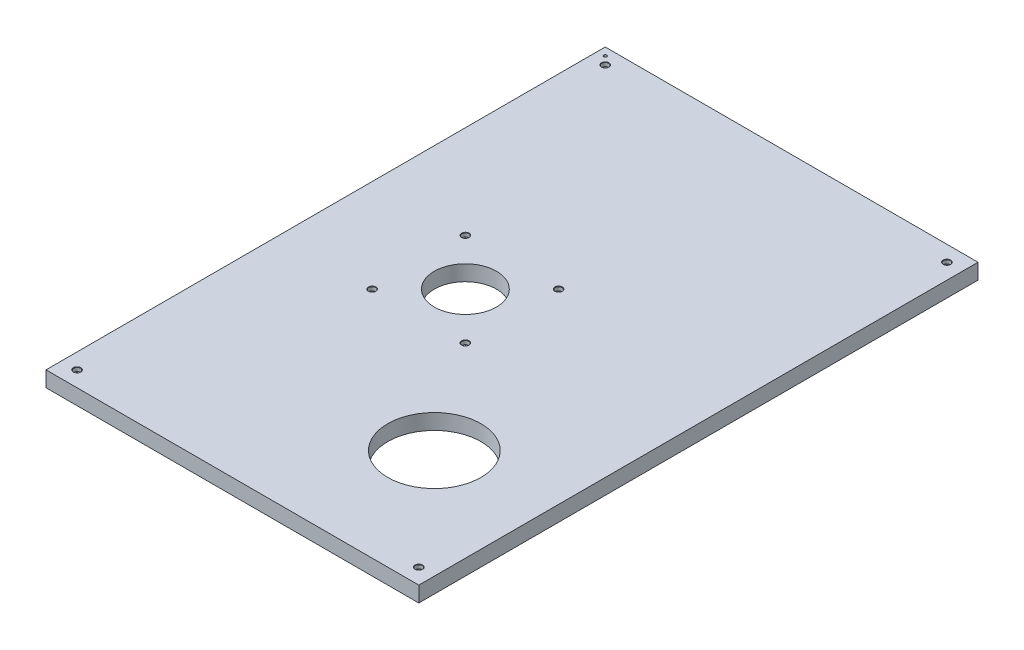
ISO-10303-21;
HEADER;
FILE_DESCRIPTION(('STEP AP214'),'2;1');
FILE_NAME('part.step','',(''),(''),'','','');
FILE_SCHEMA(('AUTOMOTIVE_DESIGN { 1 0 10303 214 1 1 1 1 }'));
ENDSEC;
DATA;
#1=APPLICATION_CONTEXT('core data for automotive mechanical design processes');
#2=APPLICATION_PROTOCOL_DEFINITION('international standard','automotive_design',2000,#1);
#3=PRODUCT_CONTEXT('',#1,'mechanical');
#4=PRODUCT('Part','Part','',(#3));
#5=PRODUCT_RELATED_PRODUCT_CATEGORY('part','',(#4));
#6=PRODUCT_DEFINITION_FORMATION('','',#4);
#7=PRODUCT_DEFINITION_CONTEXT('part definition',#1,'design');
#8=PRODUCT_DEFINITION('design','',#6,#7);
#9=PRODUCT_DEFINITION_SHAPE('','',#8);
#10=(LENGTH_UNIT() NAMED_UNIT(*) SI_UNIT(.MILLI.,.METRE.));
#11=(NAMED_UNIT(*) PLANE_ANGLE_UNIT() SI_UNIT($,.RADIAN.));
#12=(NAMED_UNIT(*) SI_UNIT($,.STERADIAN.) SOLID_ANGLE_UNIT());
#13=UNCERTAINTY_MEASURE_WITH_UNIT(LENGTH_MEASURE(1.E-05),#10,'distance_accuracy_value','');
#14=(GEOMETRIC_REPRESENTATION_CONTEXT(3) GLOBAL_UNCERTAINTY_ASSIGNED_CONTEXT((#13)) GLOBAL_UNIT_ASSIGNED_CONTEXT((#10,
#11,#12)) REPRESENTATION_CONTEXT('',''));
#15=CARTESIAN_POINT('',(0.,0.,0.));
#16=DIRECTION('',(0.,0.,1.));
#17=DIRECTION('',(1.,0.,0.));
#18=AXIS2_PLACEMENT_3D('',#15,#16,#17);
#19=CARTESIAN_POINT('',(354.288466199869,25.4,-449.231743950355));
#20=DIRECTION('',(1.,0.,0.));
#21=DIRECTION('',(0.,0.,-1.));
#22=AXIS2_PLACEMENT_3D('',#19,#20,#21);
#23=PLANE('',#22);
#24=DIRECTION('',(0.,0.,1.));
#25=VECTOR('',#24,1.);
#26=CARTESIAN_POINT('',(354.288466199869,0.,-449.231743950355));
#27=LINE('',#26,#25);
#28=CARTESIAN_POINT('',(354.288466199869,0.,-449.231743950355));
#29=VERTEX_POINT('',#28);
#30=CARTESIAN_POINT('',(354.288466199869,0.,465.168256049645));
#31=VERTEX_POINT('',#30);
#32=EDGE_CURVE('E97',#29,#31,#27,.T.);
#33=ORIENTED_EDGE('',*,*,#32,.T.);
#34=DIRECTION('',(0.,-1.,0.));
#35=VECTOR('',#34,1.);
#36=CARTESIAN_POINT('',(354.288466199869,25.4,465.168256049645));
#37=LINE('',#36,#35);
#38=CARTESIAN_POINT('',(354.288466199869,25.4,465.168256049645));
#39=VERTEX_POINT('',#38);
#40=EDGE_CURVE('E11',#39,#31,#37,.T.);
#41=ORIENTED_EDGE('',*,*,#40,.F.);
#42=DIRECTION('',(0.,0.,1.));
#43=VECTOR('',#42,1.);
#44=CARTESIAN_POINT('',(354.288466199869,25.4,-449.231743950355));
#45=LINE('',#44,#43);
#46=CARTESIAN_POINT('',(354.288466199869,25.4,-449.231743950355));
#47=VERTEX_POINT('',#46);
#48=EDGE_CURVE('E85',#47,#39,#45,.T.);
#49=ORIENTED_EDGE('',*,*,#48,.F.);
#50=DIRECTION('',(0.,-1.,0.));
#51=VECTOR('',#50,1.);
#52=CARTESIAN_POINT('',(354.288466199869,25.4,-449.231743950355));
#53=LINE('',#52,#51);
#54=EDGE_CURVE('E93',#47,#29,#53,.T.);
#55=ORIENTED_EDGE('',*,*,#54,.T.);
#56=EDGE_LOOP('',(#33,#41,#49,#55));
#57=FACE_BOUND('',#56,.T.);
#58=ADVANCED_FACE('F34',(#57),#23,.F.);
#59=CARTESIAN_POINT('',(354.288466199869,25.4,465.168256049645));
#60=DIRECTION('',(0.,0.,-1.));
#61=DIRECTION('',(-1.,0.,0.));
#62=AXIS2_PLACEMENT_3D('',#59,#60,#61);
#63=PLANE('',#62);
#64=DIRECTION('',(1.,0.,0.));
#65=VECTOR('',#64,1.);
#66=CARTESIAN_POINT('',(354.288466199869,0.,465.168256049645));
#67=LINE('',#66,#65);
#68=CARTESIAN_POINT('',(963.888466199869,0.,465.168256049645));
#69=VERTEX_POINT('',#68);
#70=EDGE_CURVE('E89',#31,#69,#67,.T.);
#71=ORIENTED_EDGE('',*,*,#70,.T.);
#72=DIRECTION('',(0.,-1.,0.));
#73=VECTOR('',#72,1.);
#74=CARTESIAN_POINT('',(963.888466199869,25.4,465.168256049645));
#75=LINE('',#74,#73);
#76=CARTESIAN_POINT('',(963.888466199869,25.4,465.168256049645));
#77=VERTEX_POINT('',#76);
#78=EDGE_CURVE('E42',#77,#69,#75,.T.);
#79=ORIENTED_EDGE('',*,*,#78,.F.);
#80=DIRECTION('',(1.,0.,0.));
#81=VECTOR('',#80,1.);
#82=CARTESIAN_POINT('',(354.288466199869,25.4,465.168256049645));
#83=LINE('',#82,#81);
#84=EDGE_CURVE('E80',#39,#77,#83,.T.);
#85=ORIENTED_EDGE('',*,*,#84,.F.);
#86=ORIENTED_EDGE('',*,*,#40,.T.);
#87=EDGE_LOOP('',(#71,#79,#85,#86));
#88=FACE_BOUND('',#87,.T.);
#89=ADVANCED_FACE('F88',(#88),#63,.F.);
#90=CARTESIAN_POINT('',(963.888466199869,25.4,-449.231743950355));
#91=DIRECTION('',(-1.,0.,0.));
#92=DIRECTION('',(0.,0.,1.));
#93=AXIS2_PLACEMENT_3D('',#90,#91,#92);
#94=PLANE('',#93);
#95=DIRECTION('',(0.,0.,-1.));
#96=VECTOR('',#95,1.);
#97=CARTESIAN_POINT('',(963.888466199869,0.,-449.231743950355));
#98=LINE('',#97,#96);
#99=CARTESIAN_POINT('',(963.888466199869,0.,-449.231743950355));
#100=VERTEX_POINT('',#99);
#101=EDGE_CURVE('E67',#69,#100,#98,.T.);
#102=ORIENTED_EDGE('',*,*,#101,.T.);
#103=DIRECTION('',(0.,-1.,0.));
#104=VECTOR('',#103,1.);
#105=CARTESIAN_POINT('',(963.888466199869,25.4,-449.231743950355));
#106=LINE('',#105,#104);
#107=CARTESIAN_POINT('',(963.888466199869,25.4,-449.231743950355));
#108=VERTEX_POINT('',#107);
#109=EDGE_CURVE('E90',#108,#100,#106,.T.);
#110=ORIENTED_EDGE('',*,*,#109,.F.);
#111=DIRECTION('',(0.,0.,-1.));
#112=VECTOR('',#111,1.);
#113=CARTESIAN_POINT('',(963.888466199869,25.4,-449.231743950355));
#114=LINE('',#113,#112);
#115=EDGE_CURVE('E83',#77,#108,#114,.T.);
#116=ORIENTED_EDGE('',*,*,#115,.F.);
#117=ORIENTED_EDGE('',*,*,#78,.T.);
#118=EDGE_LOOP('',(#102,#110,#116,#117));
#119=FACE_BOUND('',#118,.T.);
#120=ADVANCED_FACE('F91',(#119),#94,.F.);
#121=CARTESIAN_POINT('',(354.288466199869,25.4,-449.231743950355));
#122=DIRECTION('',(0.,0.,1.));
#123=DIRECTION('',(1.,0.,0.));
#124=AXIS2_PLACEMENT_3D('',#121,#122,#123);
#125=PLANE('',#124);
#126=DIRECTION('',(-1.,0.,0.));
#127=VECTOR('',#126,1.);
#128=CARTESIAN_POINT('',(354.288466199869,0.,-449.231743950355));
#129=LINE('',#128,#127);
#130=EDGE_CURVE('E73',#100,#29,#129,.T.);
#131=ORIENTED_EDGE('',*,*,#130,.T.);
#132=ORIENTED_EDGE('',*,*,#54,.F.);
#133=DIRECTION('',(-1.,0.,0.));
#134=VECTOR('',#133,1.);
#135=CARTESIAN_POINT('',(354.288466199869,25.4,-449.231743950355));
#136=LINE('',#135,#134);
#137=EDGE_CURVE('E50',#108,#47,#136,.T.);
#138=ORIENTED_EDGE('',*,*,#137,.F.);
#139=ORIENTED_EDGE('',*,*,#109,.T.);
#140=EDGE_LOOP('',(#131,#132,#138,#139));
#141=FACE_BOUND('',#140,.T.);
#142=ADVANCED_FACE('F105',(#141),#125,.F.);
#143=CARTESIAN_POINT('',(0.,25.4,0.));
#144=DIRECTION('',(0.,1.,0.));
#145=DIRECTION('',(0.,0.,1.));
#146=AXIS2_PLACEMENT_3D('',#143,#144,#145);
#147=PLANE('',#146);
#148=CARTESIAN_POINT('',(379.688466199869,25.4,-423.831743950355));
#149=DIRECTION('',(0.,1.,0.));
#150=DIRECTION('',(0.,0.,1.));
#151=AXIS2_PLACEMENT_3D('',#148,#149,#150);
#152=CIRCLE('',#151,6.19124999999998);
#153=CARTESIAN_POINT('',(379.688466199869,25.4,-417.640493950355));
#154=VERTEX_POINT('',#153);
#155=EDGE_CURVE('E245',#154,#154,#152,.T.);
#156=ORIENTED_EDGE('',*,*,#155,.F.);
#157=EDGE_LOOP('',(#156));
#158=FACE_BOUND('',#157,.T.);
#159=CARTESIAN_POINT('',(938.488466199869,25.4,-423.831743950355));
#160=DIRECTION('',(0.,1.,0.));
#161=DIRECTION('',(0.,0.,1.));
#162=AXIS2_PLACEMENT_3D('',#159,#160,#161);
#163=CIRCLE('',#162,6.19124999999998);
#164=CARTESIAN_POINT('',(938.488466199869,25.4,-417.640493950355));
#165=VERTEX_POINT('',#164);
#166=EDGE_CURVE('E230',#165,#165,#163,.T.);
#167=ORIENTED_EDGE('',*,*,#166,.F.);
#168=EDGE_LOOP('',(#167));
#169=FACE_BOUND('',#168,.T.);
#170=CARTESIAN_POINT('',(938.488466199869,25.4,439.768256049645));
#171=DIRECTION('',(0.,1.,0.));
#172=DIRECTION('',(0.,0.,1.));
#173=AXIS2_PLACEMENT_3D('',#170,#171,#172);
#174=CIRCLE('',#173,6.19124999999998);
#175=CARTESIAN_POINT('',(938.488466199869,25.4,445.959506049645));
#176=VERTEX_POINT('',#175);
#177=EDGE_CURVE('E215',#176,#176,#174,.T.);
#178=ORIENTED_EDGE('',*,*,#177,.F.);
#179=EDGE_LOOP('',(#178));
#180=FACE_BOUND('',#179,.T.);
#181=CARTESIAN_POINT('',(379.688466199869,25.4,439.768256049645));
#182=DIRECTION('',(0.,1.,0.));
#183=DIRECTION('',(0.,0.,1.));
#184=AXIS2_PLACEMENT_3D('',#181,#182,#183);
#185=CIRCLE('',#184,6.19124999999998);
#186=CARTESIAN_POINT('',(379.688466199869,25.4,445.959506049645));
#187=VERTEX_POINT('',#186);
#188=EDGE_CURVE('E200',#187,#187,#185,.T.);
#189=ORIENTED_EDGE('',*,*,#188,.F.);
#190=EDGE_LOOP('',(#189));
#191=FACE_BOUND('',#190,.T.);
#192=CARTESIAN_POINT('',(506.688466199869,25.4,84.168256049645));
#193=DIRECTION('',(0.,1.,0.));
#194=DIRECTION('',(0.,0.,1.));
#195=AXIS2_PLACEMENT_3D('',#192,#193,#194);
#196=CIRCLE('',#195,6.19124999999998);
#197=CARTESIAN_POINT('',(506.688466199869,25.4,90.359506049645));
#198=VERTEX_POINT('',#197);
#199=EDGE_CURVE('E185',#198,#198,#196,.T.);
#200=ORIENTED_EDGE('',*,*,#199,.F.);
#201=EDGE_LOOP('',(#200));
#202=FACE_BOUND('',#201,.T.);
#203=CARTESIAN_POINT('',(659.088466199869,25.4,84.168256049645));
#204=DIRECTION('',(0.,1.,0.));
#205=DIRECTION('',(0.,0.,1.));
#206=AXIS2_PLACEMENT_3D('',#203,#204,#205);
#207=CIRCLE('',#206,6.19124999999998);
#208=CARTESIAN_POINT('',(659.088466199869,25.4,90.359506049645));
#209=VERTEX_POINT('',#208);
#210=EDGE_CURVE('E170',#209,#209,#207,.T.);
#211=ORIENTED_EDGE('',*,*,#210,.F.);
#212=EDGE_LOOP('',(#211));
#213=FACE_BOUND('',#212,.T.);
#214=CARTESIAN_POINT('',(659.088466199869,25.4,-68.231743950355));
#215=DIRECTION('',(0.,1.,0.));
#216=DIRECTION('',(0.,0.,1.));
#217=AXIS2_PLACEMENT_3D('',#214,#215,#216);
#218=CIRCLE('',#217,6.19124999999998);
#219=CARTESIAN_POINT('',(659.088466199869,25.4,-62.040493950355));
#220=VERTEX_POINT('',#219);
#221=EDGE_CURVE('E155',#220,#220,#218,.T.);
#222=ORIENTED_EDGE('',*,*,#221,.F.);
#223=EDGE_LOOP('',(#222));
#224=FACE_BOUND('',#223,.T.);
#225=CARTESIAN_POINT('',(506.688466199869,25.4,-68.231743950355));
#226=DIRECTION('',(0.,1.,0.));
#227=DIRECTION('',(0.,0.,1.));
#228=AXIS2_PLACEMENT_3D('',#225,#226,#227);
#229=CIRCLE('',#228,6.19124999999998);
#230=CARTESIAN_POINT('',(506.688466199869,25.4,-62.040493950355));
#231=VERTEX_POINT('',#230);
#232=EDGE_CURVE('E140',#231,#231,#229,.T.);
#233=ORIENTED_EDGE('',*,*,#232,.F.);
#234=EDGE_LOOP('',(#233));
#235=FACE_BOUND('',#234,.T.);
#236=CARTESIAN_POINT('',(582.888466199869,25.4,7.96825604964502));
#237=DIRECTION('',(0.,1.,0.));
#238=DIRECTION('',(0.,0.,1.));
#239=AXIS2_PLACEMENT_3D('',#236,#237,#238);
#240=CIRCLE('',#239,50.8000000000001);
#241=CARTESIAN_POINT('',(582.888466199869,25.4,58.7682560496451));
#242=VERTEX_POINT('',#241);
#243=EDGE_CURVE('E123',#242,#242,#240,.T.);
#244=ORIENTED_EDGE('',*,*,#243,.F.);
#245=EDGE_LOOP('',(#244));
#246=FACE_BOUND('',#245,.T.);
#247=CARTESIAN_POINT('',(786.088466199869,25.4,261.968256049645));
#248=DIRECTION('',(0.,1.,0.));
#249=DIRECTION('',(0.,0.,1.));
#250=AXIS2_PLACEMENT_3D('',#247,#248,#249);
#251=CIRCLE('',#250,76.2000000000001);
#252=CARTESIAN_POINT('',(786.088466199869,25.4,338.168256049645));
#253=VERTEX_POINT('',#252);
#254=EDGE_CURVE('E117',#253,#253,#251,.T.);
#255=ORIENTED_EDGE('',*,*,#254,.F.);
#256=EDGE_LOOP('',(#255));
#257=FACE_BOUND('',#256,.T.);
#258=CARTESIAN_POINT('',(366.988466199869,25.4,-436.531743950355));
#259=DIRECTION('',(0.,1.,0.));
#260=DIRECTION('',(0.,0.,1.));
#261=AXIS2_PLACEMENT_3D('',#258,#259,#260);
#262=CIRCLE('',#261,2.55269999999996);
#263=CARTESIAN_POINT('',(366.988466199869,25.4,-433.979043950355));
#264=VERTEX_POINT('',#263);
#265=EDGE_CURVE('E113',#264,#264,#262,.T.);
#266=ORIENTED_EDGE('',*,*,#265,.F.);
#267=EDGE_LOOP('',(#266));
#268=FACE_BOUND('',#267,.T.);
#269=ORIENTED_EDGE('',*,*,#48,.T.);
#270=ORIENTED_EDGE('',*,*,#84,.T.);
#271=ORIENTED_EDGE('',*,*,#115,.T.);
#272=ORIENTED_EDGE('',*,*,#137,.T.);
#273=EDGE_LOOP('',(#269,#270,#271,#272));
#274=FACE_BOUND('',#273,.T.);
#275=ADVANCED_FACE('F81',(#158,#169,#180,#191,#202,#213,#224,#235,#246,#257,#268,#274),#147,.T.);
#276=CARTESIAN_POINT('',(0.,0.,0.));
#277=DIRECTION('',(0.,1.,0.));
#278=DIRECTION('',(0.,0.,1.));
#279=AXIS2_PLACEMENT_3D('',#276,#277,#278);
#280=PLANE('',#279);
#281=CARTESIAN_POINT('',(379.688466199869,0.,-423.831743950355));
#282=DIRECTION('',(0.,1.,0.));
#283=DIRECTION('',(0.,0.,1.));
#284=AXIS2_PLACEMENT_3D('',#281,#282,#283);
#285=CIRCLE('',#284,3.3782);
#286=CARTESIAN_POINT('',(379.688466199869,0.,-420.453543950355));
#287=VERTEX_POINT('',#286);
#288=EDGE_CURVE('E233',#287,#287,#285,.T.);
#289=ORIENTED_EDGE('',*,*,#288,.T.);
#290=EDGE_LOOP('',(#289));
#291=FACE_BOUND('',#290,.T.);
#292=CARTESIAN_POINT('',(938.488466199869,0.,-423.831743950355));
#293=DIRECTION('',(0.,1.,0.));
#294=DIRECTION('',(0.,0.,1.));
#295=AXIS2_PLACEMENT_3D('',#292,#293,#294);
#296=CIRCLE('',#295,3.3782);
#297=CARTESIAN_POINT('',(938.488466199869,0.,-420.453543950355));
#298=VERTEX_POINT('',#297);
#299=EDGE_CURVE('E218',#298,#298,#296,.T.);
#300=ORIENTED_EDGE('',*,*,#299,.T.);
#301=EDGE_LOOP('',(#300));
#302=FACE_BOUND('',#301,.T.);
#303=CARTESIAN_POINT('',(938.488466199869,0.,439.768256049645));
#304=DIRECTION('',(0.,1.,0.));
#305=DIRECTION('',(0.,0.,1.));
#306=AXIS2_PLACEMENT_3D('',#303,#304,#305);
#307=CIRCLE('',#306,3.3782);
#308=CARTESIAN_POINT('',(938.488466199869,0.,443.146456049645));
#309=VERTEX_POINT('',#308);
#310=EDGE_CURVE('E203',#309,#309,#307,.T.);
#311=ORIENTED_EDGE('',*,*,#310,.T.);
#312=EDGE_LOOP('',(#311));
#313=FACE_BOUND('',#312,.T.);
#314=CARTESIAN_POINT('',(379.688466199869,0.,439.768256049645));
#315=DIRECTION('',(0.,1.,0.));
#316=DIRECTION('',(0.,0.,1.));
#317=AXIS2_PLACEMENT_3D('',#314,#315,#316);
#318=CIRCLE('',#317,3.3782);
#319=CARTESIAN_POINT('',(379.688466199869,0.,443.146456049645));
#320=VERTEX_POINT('',#319);
#321=EDGE_CURVE('E188',#320,#320,#318,.T.);
#322=ORIENTED_EDGE('',*,*,#321,.T.);
#323=EDGE_LOOP('',(#322));
#324=FACE_BOUND('',#323,.T.);
#325=CARTESIAN_POINT('',(506.688466199869,0.,84.168256049645));
#326=DIRECTION('',(0.,1.,0.));
#327=DIRECTION('',(0.,0.,1.));
#328=AXIS2_PLACEMENT_3D('',#325,#326,#327);
#329=CIRCLE('',#328,3.3782);
#330=CARTESIAN_POINT('',(506.688466199869,0.,87.546456049645));
#331=VERTEX_POINT('',#330);
#332=EDGE_CURVE('E173',#331,#331,#329,.T.);
#333=ORIENTED_EDGE('',*,*,#332,.T.);
#334=EDGE_LOOP('',(#333));
#335=FACE_BOUND('',#334,.T.);
#336=CARTESIAN_POINT('',(659.088466199869,0.,84.168256049645));
#337=DIRECTION('',(0.,1.,0.));
#338=DIRECTION('',(0.,0.,1.));
#339=AXIS2_PLACEMENT_3D('',#336,#337,#338);
#340=CIRCLE('',#339,3.3782);
#341=CARTESIAN_POINT('',(659.088466199869,0.,87.546456049645));
#342=VERTEX_POINT('',#341);
#343=EDGE_CURVE('E158',#342,#342,#340,.T.);
#344=ORIENTED_EDGE('',*,*,#343,.T.);
#345=EDGE_LOOP('',(#344));
#346=FACE_BOUND('',#345,.T.);
#347=CARTESIAN_POINT('',(659.088466199869,0.,-68.231743950355));
#348=DIRECTION('',(0.,1.,0.));
#349=DIRECTION('',(0.,0.,1.));
#350=AXIS2_PLACEMENT_3D('',#347,#348,#349);
#351=CIRCLE('',#350,3.3782);
#352=CARTESIAN_POINT('',(659.088466199869,0.,-64.853543950355));
#353=VERTEX_POINT('',#352);
#354=EDGE_CURVE('E143',#353,#353,#351,.T.);
#355=ORIENTED_EDGE('',*,*,#354,.T.);
#356=EDGE_LOOP('',(#355));
#357=FACE_BOUND('',#356,.T.);
#358=CARTESIAN_POINT('',(506.688466199869,0.,-68.231743950355));
#359=DIRECTION('',(0.,1.,0.));
#360=DIRECTION('',(0.,0.,1.));
#361=AXIS2_PLACEMENT_3D('',#358,#359,#360);
#362=CIRCLE('',#361,3.3782);
#363=CARTESIAN_POINT('',(506.688466199869,0.,-64.853543950355));
#364=VERTEX_POINT('',#363);
#365=EDGE_CURVE('E126',#364,#364,#362,.T.);
#366=ORIENTED_EDGE('',*,*,#365,.T.);
#367=EDGE_LOOP('',(#366));
#368=FACE_BOUND('',#367,.T.);
#369=CARTESIAN_POINT('',(582.888466199869,0.,7.96825604964502));
#370=DIRECTION('',(0.,1.,0.));
#371=DIRECTION('',(0.,0.,1.));
#372=AXIS2_PLACEMENT_3D('',#369,#370,#371);
#373=CIRCLE('',#372,50.8000000000001);
#374=CARTESIAN_POINT('',(582.888466199869,0.,58.7682560496451));
#375=VERTEX_POINT('',#374);
#376=EDGE_CURVE('E120',#375,#375,#373,.T.);
#377=ORIENTED_EDGE('',*,*,#376,.T.);
#378=EDGE_LOOP('',(#377));
#379=FACE_BOUND('',#378,.T.);
#380=CARTESIAN_POINT('',(786.088466199869,0.,261.968256049645));
#381=DIRECTION('',(0.,1.,0.));
#382=DIRECTION('',(0.,0.,1.));
#383=AXIS2_PLACEMENT_3D('',#380,#381,#382);
#384=CIRCLE('',#383,76.2000000000001);
#385=CARTESIAN_POINT('',(786.088466199869,0.,338.168256049645));
#386=VERTEX_POINT('',#385);
#387=EDGE_CURVE('E116',#386,#386,#384,.T.);
#388=ORIENTED_EDGE('',*,*,#387,.T.);
#389=EDGE_LOOP('',(#388));
#390=FACE_BOUND('',#389,.T.);
#391=CARTESIAN_POINT('',(366.988466199869,0.,-436.531743950355));
#392=DIRECTION('',(0.,1.,0.));
#393=DIRECTION('',(0.,0.,1.));
#394=AXIS2_PLACEMENT_3D('',#391,#392,#393);
#395=CIRCLE('',#394,2.55269999999996);
#396=CARTESIAN_POINT('',(366.988466199869,0.,-433.979043950355));
#397=VERTEX_POINT('',#396);
#398=EDGE_CURVE('E100',#397,#397,#395,.T.);
#399=ORIENTED_EDGE('',*,*,#398,.T.);
#400=EDGE_LOOP('',(#399));
#401=FACE_BOUND('',#400,.T.);
#402=ORIENTED_EDGE('',*,*,#32,.F.);
#403=ORIENTED_EDGE('',*,*,#130,.F.);
#404=ORIENTED_EDGE('',*,*,#101,.F.);
#405=ORIENTED_EDGE('',*,*,#70,.F.);
#406=EDGE_LOOP('',(#402,#403,#404,#405));
#407=FACE_BOUND('',#406,.T.);
#408=ADVANCED_FACE('F108',(#291,#302,#313,#324,#335,#346,#357,#368,#379,#390,#401,#407),#280,.F.);
#409=CARTESIAN_POINT('',(366.988466199869,25.4,-436.531743950355));
#410=DIRECTION('',(0.,1.,0.));
#411=DIRECTION('',(0.,0.,1.));
#412=AXIS2_PLACEMENT_3D('',#409,#410,#411);
#413=CYLINDRICAL_SURFACE('',#412,2.55269999999996);
#414=ORIENTED_EDGE('',*,*,#398,.F.);
#415=EDGE_LOOP('',(#414));
#416=FACE_BOUND('',#415,.T.);
#417=ORIENTED_EDGE('',*,*,#265,.T.);
#418=EDGE_LOOP('',(#417));
#419=FACE_BOUND('',#418,.T.);
#420=ADVANCED_FACE('F274',(#416,#419),#413,.F.);
#421=CARTESIAN_POINT('',(786.088466199869,0.,261.968256049645));
#422=DIRECTION('',(0.,1.,0.));
#423=DIRECTION('',(0.,0.,1.));
#424=AXIS2_PLACEMENT_3D('',#421,#422,#423);
#425=CYLINDRICAL_SURFACE('',#424,76.2000000000001);
#426=ORIENTED_EDGE('',*,*,#387,.F.);
#427=EDGE_LOOP('',(#426));
#428=FACE_BOUND('',#427,.T.);
#429=ORIENTED_EDGE('',*,*,#254,.T.);
#430=EDGE_LOOP('',(#429));
#431=FACE_BOUND('',#430,.T.);
#432=ADVANCED_FACE('F276',(#428,#431),#425,.F.);
#433=CARTESIAN_POINT('',(582.888466199869,0.,7.96825604964502));
#434=DIRECTION('',(0.,1.,0.));
#435=DIRECTION('',(0.,0.,1.));
#436=AXIS2_PLACEMENT_3D('',#433,#434,#435);
#437=CYLINDRICAL_SURFACE('',#436,50.8000000000001);
#438=ORIENTED_EDGE('',*,*,#376,.F.);
#439=EDGE_LOOP('',(#438));
#440=FACE_BOUND('',#439,.T.);
#441=ORIENTED_EDGE('',*,*,#243,.T.);
#442=EDGE_LOOP('',(#441));
#443=FACE_BOUND('',#442,.T.);
#444=ADVANCED_FACE('F283',(#440,#443),#437,.F.);
#445=CARTESIAN_POINT('',(506.688466199869,25.4,-68.231743950355));
#446=DIRECTION('',(0.,1.,0.));
#447=DIRECTION('',(0.,0.,1.));
#448=AXIS2_PLACEMENT_3D('',#445,#446,#447);
#449=CYLINDRICAL_SURFACE('',#448,3.3782);
#450=ORIENTED_EDGE('',*,*,#365,.F.);
#451=EDGE_LOOP('',(#450));
#452=FACE_BOUND('',#451,.T.);
#453=CARTESIAN_POINT('',(506.688466199869,19.05,-68.231743950355));
#454=DIRECTION('',(0.,1.,0.));
#455=DIRECTION('',(0.,0.,1.));
#456=AXIS2_PLACEMENT_3D('',#453,#454,#455);
#457=CIRCLE('',#456,3.3782);
#458=CARTESIAN_POINT('',(506.688466199869,19.05,-64.853543950355));
#459=VERTEX_POINT('',#458);
#460=EDGE_CURVE('E131',#459,#459,#457,.T.);
#461=ORIENTED_EDGE('',*,*,#460,.T.);
#462=EDGE_LOOP('',(#461));
#463=FACE_BOUND('',#462,.T.);
#464=ADVANCED_FACE('F319',(#452,#463),#449,.F.);
#465=CARTESIAN_POINT('',(512.244716199869,19.05,-68.231743950355));
#466=DIRECTION('',(0.,-1.,0.));
#467=DIRECTION('',(0.,0.,-1.));
#468=AXIS2_PLACEMENT_3D('',#465,#466,#467);
#469=PLANE('',#468);
#470=ORIENTED_EDGE('',*,*,#460,.F.);
#471=EDGE_LOOP('',(#470));
#472=FACE_BOUND('',#471,.T.);
#473=CARTESIAN_POINT('',(506.688466199869,19.05,-68.231743950355));
#474=DIRECTION('',(0.,1.,0.));
#475=DIRECTION('',(0.,0.,1.));
#476=AXIS2_PLACEMENT_3D('',#473,#474,#475);
#477=CIRCLE('',#476,5.55625000000004);
#478=CARTESIAN_POINT('',(506.688466199869,19.05,-62.6754939503549));
#479=VERTEX_POINT('',#478);
#480=EDGE_CURVE('E134',#479,#479,#477,.T.);
#481=ORIENTED_EDGE('',*,*,#480,.T.);
#482=EDGE_LOOP('',(#481));
#483=FACE_BOUND('',#482,.T.);
#484=ADVANCED_FACE('F324',(#472,#483),#469,.F.);
#485=CARTESIAN_POINT('',(506.688466199869,25.4,-68.231743950355));
#486=DIRECTION('',(0.,1.,0.));
#487=DIRECTION('',(0.,0.,1.));
#488=AXIS2_PLACEMENT_3D('',#485,#486,#487);
#489=CYLINDRICAL_SURFACE('',#488,5.55625000000004);
#490=ORIENTED_EDGE('',*,*,#480,.F.);
#491=EDGE_LOOP('',(#490));
#492=FACE_BOUND('',#491,.T.);
#493=CARTESIAN_POINT('',(506.688466199869,24.765,-68.231743950355));
#494=DIRECTION('',(0.,1.,0.));
#495=DIRECTION('',(0.,0.,1.));
#496=AXIS2_PLACEMENT_3D('',#493,#494,#495);
#497=CIRCLE('',#496,5.55625000000004);
#498=CARTESIAN_POINT('',(506.688466199869,24.765,-62.6754939503549));
#499=VERTEX_POINT('',#498);
#500=EDGE_CURVE('E137',#499,#499,#497,.T.);
#501=ORIENTED_EDGE('',*,*,#500,.T.);
#502=EDGE_LOOP('',(#501));
#503=FACE_BOUND('',#502,.T.);
#504=ADVANCED_FACE('F336',(#492,#503),#489,.F.);
#505=CARTESIAN_POINT('',(506.688466199869,25.4,-68.231743950355));
#506=DIRECTION('',(0.,1.,0.));
#507=DIRECTION('',(0.,0.,1.));
#508=AXIS2_PLACEMENT_3D('',#505,#506,#507);
#509=CONICAL_SURFACE('',#508,6.19124999999998,0.785398163397396);
#510=ORIENTED_EDGE('',*,*,#500,.F.);
#511=EDGE_LOOP('',(#510));
#512=FACE_BOUND('',#511,.T.);
#513=ORIENTED_EDGE('',*,*,#232,.T.);
#514=EDGE_LOOP('',(#513));
#515=FACE_BOUND('',#514,.T.);
#516=ADVANCED_FACE('F346',(#512,#515),#509,.F.);
#517=CARTESIAN_POINT('',(659.088466199869,25.4,-68.231743950355));
#518=DIRECTION('',(0.,1.,0.));
#519=DIRECTION('',(0.,0.,1.));
#520=AXIS2_PLACEMENT_3D('',#517,#518,#519);
#521=CYLINDRICAL_SURFACE('',#520,3.3782);
#522=ORIENTED_EDGE('',*,*,#354,.F.);
#523=EDGE_LOOP('',(#522));
#524=FACE_BOUND('',#523,.T.);
#525=CARTESIAN_POINT('',(659.088466199869,19.05,-68.231743950355));
#526=DIRECTION('',(0.,1.,0.));
#527=DIRECTION('',(0.,0.,1.));
#528=AXIS2_PLACEMENT_3D('',#525,#526,#527);
#529=CIRCLE('',#528,3.3782);
#530=CARTESIAN_POINT('',(659.088466199869,19.05,-64.853543950355));
#531=VERTEX_POINT('',#530);
#532=EDGE_CURVE('E146',#531,#531,#529,.T.);
#533=ORIENTED_EDGE('',*,*,#532,.T.);
#534=EDGE_LOOP('',(#533));
#535=FACE_BOUND('',#534,.T.);
#536=ADVANCED_FACE('F356',(#524,#535),#521,.F.);
#537=CARTESIAN_POINT('',(664.644716199869,19.05,-68.231743950355));
#538=DIRECTION('',(0.,-1.,0.));
#539=DIRECTION('',(0.,0.,-1.));
#540=AXIS2_PLACEMENT_3D('',#537,#538,#539);
#541=PLANE('',#540);
#542=ORIENTED_EDGE('',*,*,#532,.F.);
#543=EDGE_LOOP('',(#542));
#544=FACE_BOUND('',#543,.T.);
#545=CARTESIAN_POINT('',(659.088466199869,19.05,-68.231743950355));
#546=DIRECTION('',(0.,1.,0.));
#547=DIRECTION('',(0.,0.,1.));
#548=AXIS2_PLACEMENT_3D('',#545,#546,#547);
#549=CIRCLE('',#548,5.55625000000004);
#550=CARTESIAN_POINT('',(659.088466199869,19.05,-62.6754939503549));
#551=VERTEX_POINT('',#550);
#552=EDGE_CURVE('E149',#551,#551,#549,.T.);
#553=ORIENTED_EDGE('',*,*,#552,.T.);
#554=EDGE_LOOP('',(#553));
#555=FACE_BOUND('',#554,.T.);
#556=ADVANCED_FACE('F366',(#544,#555),#541,.F.);
#557=CARTESIAN_POINT('',(659.088466199869,25.4,-68.231743950355));
#558=DIRECTION('',(0.,1.,0.));
#559=DIRECTION('',(0.,0.,1.));
#560=AXIS2_PLACEMENT_3D('',#557,#558,#559);
#561=CYLINDRICAL_SURFACE('',#560,5.55625000000004);
#562=ORIENTED_EDGE('',*,*,#552,.F.);
#563=EDGE_LOOP('',(#562));
#564=FACE_BOUND('',#563,.T.);
#565=CARTESIAN_POINT('',(659.088466199869,24.765,-68.231743950355));
#566=DIRECTION('',(0.,1.,0.));
#567=DIRECTION('',(0.,0.,1.));
#568=AXIS2_PLACEMENT_3D('',#565,#566,#567);
#569=CIRCLE('',#568,5.55625000000004);
#570=CARTESIAN_POINT('',(659.088466199869,24.765,-62.6754939503549));
#571=VERTEX_POINT('',#570);
#572=EDGE_CURVE('E152',#571,#571,#569,.T.);
#573=ORIENTED_EDGE('',*,*,#572,.T.);
#574=EDGE_LOOP('',(#573));
#575=FACE_BOUND('',#574,.T.);
#576=ADVANCED_FACE('F376',(#564,#575),#561,.F.);
#577=CARTESIAN_POINT('',(659.088466199869,25.4,-68.231743950355));
#578=DIRECTION('',(0.,1.,0.));
#579=DIRECTION('',(0.,0.,1.));
#580=AXIS2_PLACEMENT_3D('',#577,#578,#579);
#581=CONICAL_SURFACE('',#580,6.19124999999998,0.785398163397396);
#582=ORIENTED_EDGE('',*,*,#572,.F.);
#583=EDGE_LOOP('',(#582));
#584=FACE_BOUND('',#583,.T.);
#585=ORIENTED_EDGE('',*,*,#221,.T.);
#586=EDGE_LOOP('',(#585));
#587=FACE_BOUND('',#586,.T.);
#588=ADVANCED_FACE('F386',(#584,#587),#581,.F.);
#589=CARTESIAN_POINT('',(659.088466199869,25.4,84.168256049645));
#590=DIRECTION('',(0.,1.,0.));
#591=DIRECTION('',(0.,0.,1.));
#592=AXIS2_PLACEMENT_3D('',#589,#590,#591);
#593=CYLINDRICAL_SURFACE('',#592,3.3782);
#594=ORIENTED_EDGE('',*,*,#343,.F.);
#595=EDGE_LOOP('',(#594));
#596=FACE_BOUND('',#595,.T.);
#597=CARTESIAN_POINT('',(659.088466199869,19.05,84.168256049645));
#598=DIRECTION('',(0.,1.,0.));
#599=DIRECTION('',(0.,0.,1.));
#600=AXIS2_PLACEMENT_3D('',#597,#598,#599);
#601=CIRCLE('',#600,3.3782);
#602=CARTESIAN_POINT('',(659.088466199869,19.05,87.546456049645));
#603=VERTEX_POINT('',#602);
#604=EDGE_CURVE('E161',#603,#603,#601,.T.);
#605=ORIENTED_EDGE('',*,*,#604,.T.);
#606=EDGE_LOOP('',(#605));
#607=FACE_BOUND('',#606,.T.);
#608=ADVANCED_FACE('F396',(#596,#607),#593,.F.);
#609=CARTESIAN_POINT('',(664.644716199869,19.05,84.168256049645));
#610=DIRECTION('',(0.,-1.,0.));
#611=DIRECTION('',(0.,0.,-1.));
#612=AXIS2_PLACEMENT_3D('',#609,#610,#611);
#613=PLANE('',#612);
#614=ORIENTED_EDGE('',*,*,#604,.F.);
#615=EDGE_LOOP('',(#614));
#616=FACE_BOUND('',#615,.T.);
#617=CARTESIAN_POINT('',(659.088466199869,19.05,84.168256049645));
#618=DIRECTION('',(0.,1.,0.));
#619=DIRECTION('',(0.,0.,1.));
#620=AXIS2_PLACEMENT_3D('',#617,#618,#619);
#621=CIRCLE('',#620,5.55625000000004);
#622=CARTESIAN_POINT('',(659.088466199869,19.05,89.7245060496451));
#623=VERTEX_POINT('',#622);
#624=EDGE_CURVE('E164',#623,#623,#621,.T.);
#625=ORIENTED_EDGE('',*,*,#624,.T.);
#626=EDGE_LOOP('',(#625));
#627=FACE_BOUND('',#626,.T.);
#628=ADVANCED_FACE('F406',(#616,#627),#613,.F.);
#629=CARTESIAN_POINT('',(659.088466199869,25.4,84.168256049645));
#630=DIRECTION('',(0.,1.,0.));
#631=DIRECTION('',(0.,0.,1.));
#632=AXIS2_PLACEMENT_3D('',#629,#630,#631);
#633=CYLINDRICAL_SURFACE('',#632,5.55625000000004);
#634=ORIENTED_EDGE('',*,*,#624,.F.);
#635=EDGE_LOOP('',(#634));
#636=FACE_BOUND('',#635,.T.);
#637=CARTESIAN_POINT('',(659.088466199869,24.765,84.168256049645));
#638=DIRECTION('',(0.,1.,0.));
#639=DIRECTION('',(0.,0.,1.));
#640=AXIS2_PLACEMENT_3D('',#637,#638,#639);
#641=CIRCLE('',#640,5.55625000000004);
#642=CARTESIAN_POINT('',(659.088466199869,24.765,89.7245060496451));
#643=VERTEX_POINT('',#642);
#644=EDGE_CURVE('E167',#643,#643,#641,.T.);
#645=ORIENTED_EDGE('',*,*,#644,.T.);
#646=EDGE_LOOP('',(#645));
#647=FACE_BOUND('',#646,.T.);
#648=ADVANCED_FACE('F416',(#636,#647),#633,.F.);
#649=CARTESIAN_POINT('',(659.088466199869,25.4,84.168256049645));
#650=DIRECTION('',(0.,1.,0.));
#651=DIRECTION('',(0.,0.,1.));
#652=AXIS2_PLACEMENT_3D('',#649,#650,#651);
#653=CONICAL_SURFACE('',#652,6.19124999999998,0.785398163397396);
#654=ORIENTED_EDGE('',*,*,#644,.F.);
#655=EDGE_LOOP('',(#654));
#656=FACE_BOUND('',#655,.T.);
#657=ORIENTED_EDGE('',*,*,#210,.T.);
#658=EDGE_LOOP('',(#657));
#659=FACE_BOUND('',#658,.T.);
#660=ADVANCED_FACE('F426',(#656,#659),#653,.F.);
#661=CARTESIAN_POINT('',(506.688466199869,25.4,84.168256049645));
#662=DIRECTION('',(0.,1.,0.));
#663=DIRECTION('',(0.,0.,1.));
#664=AXIS2_PLACEMENT_3D('',#661,#662,#663);
#665=CYLINDRICAL_SURFACE('',#664,3.3782);
#666=ORIENTED_EDGE('',*,*,#332,.F.);
#667=EDGE_LOOP('',(#666));
#668=FACE_BOUND('',#667,.T.);
#669=CARTESIAN_POINT('',(506.688466199869,19.05,84.168256049645));
#670=DIRECTION('',(0.,1.,0.));
#671=DIRECTION('',(0.,0.,1.));
#672=AXIS2_PLACEMENT_3D('',#669,#670,#671);
#673=CIRCLE('',#672,3.3782);
#674=CARTESIAN_POINT('',(506.688466199869,19.05,87.546456049645));
#675=VERTEX_POINT('',#674);
#676=EDGE_CURVE('E176',#675,#675,#673,.T.);
#677=ORIENTED_EDGE('',*,*,#676,.T.);
#678=EDGE_LOOP('',(#677));
#679=FACE_BOUND('',#678,.T.);
#680=ADVANCED_FACE('F436',(#668,#679),#665,.F.);
#681=CARTESIAN_POINT('',(512.244716199869,19.05,84.168256049645));
#682=DIRECTION('',(0.,-1.,0.));
#683=DIRECTION('',(0.,0.,-1.));
#684=AXIS2_PLACEMENT_3D('',#681,#682,#683);
#685=PLANE('',#684);
#686=ORIENTED_EDGE('',*,*,#676,.F.);
#687=EDGE_LOOP('',(#686));
#688=FACE_BOUND('',#687,.T.);
#689=CARTESIAN_POINT('',(506.688466199869,19.05,84.168256049645));
#690=DIRECTION('',(0.,1.,0.));
#691=DIRECTION('',(0.,0.,1.));
#692=AXIS2_PLACEMENT_3D('',#689,#690,#691);
#693=CIRCLE('',#692,5.55625000000004);
#694=CARTESIAN_POINT('',(506.688466199869,19.05,89.7245060496451));
#695=VERTEX_POINT('',#694);
#696=EDGE_CURVE('E179',#695,#695,#693,.T.);
#697=ORIENTED_EDGE('',*,*,#696,.T.);
#698=EDGE_LOOP('',(#697));
#699=FACE_BOUND('',#698,.T.);
#700=ADVANCED_FACE('F446',(#688,#699),#685,.F.);
#701=CARTESIAN_POINT('',(506.688466199869,25.4,84.168256049645));
#702=DIRECTION('',(0.,1.,0.));
#703=DIRECTION('',(0.,0.,1.));
#704=AXIS2_PLACEMENT_3D('',#701,#702,#703);
#705=CYLINDRICAL_SURFACE('',#704,5.55625000000004);
#706=ORIENTED_EDGE('',*,*,#696,.F.);
#707=EDGE_LOOP('',(#706));
#708=FACE_BOUND('',#707,.T.);
#709=CARTESIAN_POINT('',(506.688466199869,24.765,84.168256049645));
#710=DIRECTION('',(0.,1.,0.));
#711=DIRECTION('',(0.,0.,1.));
#712=AXIS2_PLACEMENT_3D('',#709,#710,#711);
#713=CIRCLE('',#712,5.55625000000004);
#714=CARTESIAN_POINT('',(506.688466199869,24.765,89.7245060496451));
#715=VERTEX_POINT('',#714);
#716=EDGE_CURVE('E182',#715,#715,#713,.T.);
#717=ORIENTED_EDGE('',*,*,#716,.T.);
#718=EDGE_LOOP('',(#717));
#719=FACE_BOUND('',#718,.T.);
#720=ADVANCED_FACE('F456',(#708,#719),#705,.F.);
#721=CARTESIAN_POINT('',(506.688466199869,25.4,84.168256049645));
#722=DIRECTION('',(0.,1.,0.));
#723=DIRECTION('',(0.,0.,1.));
#724=AXIS2_PLACEMENT_3D('',#721,#722,#723);
#725=CONICAL_SURFACE('',#724,6.19124999999998,0.785398163397396);
#726=ORIENTED_EDGE('',*,*,#716,.F.);
#727=EDGE_LOOP('',(#726));
#728=FACE_BOUND('',#727,.T.);
#729=ORIENTED_EDGE('',*,*,#199,.T.);
#730=EDGE_LOOP('',(#729));
#731=FACE_BOUND('',#730,.T.);
#732=ADVANCED_FACE('F466',(#728,#731),#725,.F.);
#733=CARTESIAN_POINT('',(379.688466199869,25.4,439.768256049645));
#734=DIRECTION('',(0.,1.,0.));
#735=DIRECTION('',(0.,0.,1.));
#736=AXIS2_PLACEMENT_3D('',#733,#734,#735);
#737=CYLINDRICAL_SURFACE('',#736,3.3782);
#738=ORIENTED_EDGE('',*,*,#321,.F.);
#739=EDGE_LOOP('',(#738));
#740=FACE_BOUND('',#739,.T.);
#741=CARTESIAN_POINT('',(379.688466199869,19.05,439.768256049645));
#742=DIRECTION('',(0.,1.,0.));
#743=DIRECTION('',(0.,0.,1.));
#744=AXIS2_PLACEMENT_3D('',#741,#742,#743);
#745=CIRCLE('',#744,3.3782);
#746=CARTESIAN_POINT('',(379.688466199869,19.05,443.146456049645));
#747=VERTEX_POINT('',#746);
#748=EDGE_CURVE('E191',#747,#747,#745,.T.);
#749=ORIENTED_EDGE('',*,*,#748,.T.);
#750=EDGE_LOOP('',(#749));
#751=FACE_BOUND('',#750,.T.);
#752=ADVANCED_FACE('F476',(#740,#751),#737,.F.);
#753=CARTESIAN_POINT('',(385.244716199869,19.05,439.768256049645));
#754=DIRECTION('',(0.,-1.,0.));
#755=DIRECTION('',(0.,0.,-1.));
#756=AXIS2_PLACEMENT_3D('',#753,#754,#755);
#757=PLANE('',#756);
#758=ORIENTED_EDGE('',*,*,#748,.F.);
#759=EDGE_LOOP('',(#758));
#760=FACE_BOUND('',#759,.T.);
#761=CARTESIAN_POINT('',(379.688466199869,19.05,439.768256049645));
#762=DIRECTION('',(0.,1.,0.));
#763=DIRECTION('',(0.,0.,1.));
#764=AXIS2_PLACEMENT_3D('',#761,#762,#763);
#765=CIRCLE('',#764,5.55624999999998);
#766=CARTESIAN_POINT('',(379.688466199869,19.05,445.324506049645));
#767=VERTEX_POINT('',#766);
#768=EDGE_CURVE('E194',#767,#767,#765,.T.);
#769=ORIENTED_EDGE('',*,*,#768,.T.);
#770=EDGE_LOOP('',(#769));
#771=FACE_BOUND('',#770,.T.);
#772=ADVANCED_FACE('F486',(#760,#771),#757,.F.);
#773=CARTESIAN_POINT('',(379.688466199869,25.4,439.768256049645));
#774=DIRECTION('',(0.,1.,0.));
#775=DIRECTION('',(0.,0.,1.));
#776=AXIS2_PLACEMENT_3D('',#773,#774,#775);
#777=CYLINDRICAL_SURFACE('',#776,5.55624999999998);
#778=ORIENTED_EDGE('',*,*,#768,.F.);
#779=EDGE_LOOP('',(#778));
#780=FACE_BOUND('',#779,.T.);
#781=CARTESIAN_POINT('',(379.688466199869,24.765,439.768256049645));
#782=DIRECTION('',(0.,1.,0.));
#783=DIRECTION('',(0.,0.,1.));
#784=AXIS2_PLACEMENT_3D('',#781,#782,#783);
#785=CIRCLE('',#784,5.55624999999998);
#786=CARTESIAN_POINT('',(379.688466199869,24.765,445.324506049645));
#787=VERTEX_POINT('',#786);
#788=EDGE_CURVE('E197',#787,#787,#785,.T.);
#789=ORIENTED_EDGE('',*,*,#788,.T.);
#790=EDGE_LOOP('',(#789));
#791=FACE_BOUND('',#790,.T.);
#792=ADVANCED_FACE('F496',(#780,#791),#777,.F.);
#793=CARTESIAN_POINT('',(379.688466199869,25.4,439.768256049645));
#794=DIRECTION('',(0.,1.,0.));
#795=DIRECTION('',(0.,0.,1.));
#796=AXIS2_PLACEMENT_3D('',#793,#794,#795);
#797=CONICAL_SURFACE('',#796,6.19124999999998,0.78539816339744);
#798=ORIENTED_EDGE('',*,*,#788,.F.);
#799=EDGE_LOOP('',(#798));
#800=FACE_BOUND('',#799,.T.);
#801=ORIENTED_EDGE('',*,*,#188,.T.);
#802=EDGE_LOOP('',(#801));
#803=FACE_BOUND('',#802,.T.);
#804=ADVANCED_FACE('F506',(#800,#803),#797,.F.);
#805=CARTESIAN_POINT('',(938.488466199869,25.4,439.768256049645));
#806=DIRECTION('',(0.,1.,0.));
#807=DIRECTION('',(0.,0.,1.));
#808=AXIS2_PLACEMENT_3D('',#805,#806,#807);
#809=CYLINDRICAL_SURFACE('',#808,3.3782);
#810=ORIENTED_EDGE('',*,*,#310,.F.);
#811=EDGE_LOOP('',(#810));
#812=FACE_BOUND('',#811,.T.);
#813=CARTESIAN_POINT('',(938.488466199869,19.05,439.768256049645));
#814=DIRECTION('',(0.,1.,0.));
#815=DIRECTION('',(0.,0.,1.));
#816=AXIS2_PLACEMENT_3D('',#813,#814,#815);
#817=CIRCLE('',#816,3.3782);
#818=CARTESIAN_POINT('',(938.488466199869,19.05,443.146456049645));
#819=VERTEX_POINT('',#818);
#820=EDGE_CURVE('E206',#819,#819,#817,.T.);
#821=ORIENTED_EDGE('',*,*,#820,.T.);
#822=EDGE_LOOP('',(#821));
#823=FACE_BOUND('',#822,.T.);
#824=ADVANCED_FACE('F516',(#812,#823),#809,.F.);
#825=CARTESIAN_POINT('',(944.044716199869,19.05,439.768256049645));
#826=DIRECTION('',(0.,-1.,0.));
#827=DIRECTION('',(0.,0.,-1.));
#828=AXIS2_PLACEMENT_3D('',#825,#826,#827);
#829=PLANE('',#828);
#830=ORIENTED_EDGE('',*,*,#820,.F.);
#831=EDGE_LOOP('',(#830));
#832=FACE_BOUND('',#831,.T.);
#833=CARTESIAN_POINT('',(938.488466199869,19.05,439.768256049645));
#834=DIRECTION('',(0.,1.,0.));
#835=DIRECTION('',(0.,0.,1.));
#836=AXIS2_PLACEMENT_3D('',#833,#834,#835);
#837=CIRCLE('',#836,5.55625000000004);
#838=CARTESIAN_POINT('',(938.488466199869,19.05,445.324506049645));
#839=VERTEX_POINT('',#838);
#840=EDGE_CURVE('E209',#839,#839,#837,.T.);
#841=ORIENTED_EDGE('',*,*,#840,.T.);
#842=EDGE_LOOP('',(#841));
#843=FACE_BOUND('',#842,.T.);
#844=ADVANCED_FACE('F526',(#832,#843),#829,.F.);
#845=CARTESIAN_POINT('',(938.488466199869,25.4,439.768256049645));
#846=DIRECTION('',(0.,1.,0.));
#847=DIRECTION('',(0.,0.,1.));
#848=AXIS2_PLACEMENT_3D('',#845,#846,#847);
#849=CYLINDRICAL_SURFACE('',#848,5.55625000000004);
#850=ORIENTED_EDGE('',*,*,#840,.F.);
#851=EDGE_LOOP('',(#850));
#852=FACE_BOUND('',#851,.T.);
#853=CARTESIAN_POINT('',(938.488466199869,24.765,439.768256049645));
#854=DIRECTION('',(0.,1.,0.));
#855=DIRECTION('',(0.,0.,1.));
#856=AXIS2_PLACEMENT_3D('',#853,#854,#855);
#857=CIRCLE('',#856,5.55625000000004);
#858=CARTESIAN_POINT('',(938.488466199869,24.765,445.324506049645));
#859=VERTEX_POINT('',#858);
#860=EDGE_CURVE('E212',#859,#859,#857,.T.);
#861=ORIENTED_EDGE('',*,*,#860,.T.);
#862=EDGE_LOOP('',(#861));
#863=FACE_BOUND('',#862,.T.);
#864=ADVANCED_FACE('F536',(#852,#863),#849,.F.);
#865=CARTESIAN_POINT('',(938.488466199869,25.4,439.768256049645));
#866=DIRECTION('',(0.,1.,0.));
#867=DIRECTION('',(0.,0.,1.));
#868=AXIS2_PLACEMENT_3D('',#865,#866,#867);
#869=CONICAL_SURFACE('',#868,6.19124999999998,0.785398163397396);
#870=ORIENTED_EDGE('',*,*,#860,.F.);
#871=EDGE_LOOP('',(#870));
#872=FACE_BOUND('',#871,.T.);
#873=ORIENTED_EDGE('',*,*,#177,.T.);
#874=EDGE_LOOP('',(#873));
#875=FACE_BOUND('',#874,.T.);
#876=ADVANCED_FACE('F546',(#872,#875),#869,.F.);
#877=CARTESIAN_POINT('',(938.488466199869,25.4,-423.831743950355));
#878=DIRECTION('',(0.,1.,0.));
#879=DIRECTION('',(0.,0.,1.));
#880=AXIS2_PLACEMENT_3D('',#877,#878,#879);
#881=CYLINDRICAL_SURFACE('',#880,3.3782);
#882=ORIENTED_EDGE('',*,*,#299,.F.);
#883=EDGE_LOOP('',(#882));
#884=FACE_BOUND('',#883,.T.);
#885=CARTESIAN_POINT('',(938.488466199869,19.05,-423.831743950355));
#886=DIRECTION('',(0.,1.,0.));
#887=DIRECTION('',(0.,0.,1.));
#888=AXIS2_PLACEMENT_3D('',#885,#886,#887);
#889=CIRCLE('',#888,3.3782);
#890=CARTESIAN_POINT('',(938.488466199869,19.05,-420.453543950355));
#891=VERTEX_POINT('',#890);
#892=EDGE_CURVE('E221',#891,#891,#889,.T.);
#893=ORIENTED_EDGE('',*,*,#892,.T.);
#894=EDGE_LOOP('',(#893));
#895=FACE_BOUND('',#894,.T.);
#896=ADVANCED_FACE('F556',(#884,#895),#881,.F.);
#897=CARTESIAN_POINT('',(944.044716199869,19.05,-423.831743950355));
#898=DIRECTION('',(0.,-1.,0.));
#899=DIRECTION('',(0.,0.,-1.));
#900=AXIS2_PLACEMENT_3D('',#897,#898,#899);
#901=PLANE('',#900);
#902=ORIENTED_EDGE('',*,*,#892,.F.);
#903=EDGE_LOOP('',(#902));
#904=FACE_BOUND('',#903,.T.);
#905=CARTESIAN_POINT('',(938.488466199869,19.05,-423.831743950355));
#906=DIRECTION('',(0.,1.,0.));
#907=DIRECTION('',(0.,0.,1.));
#908=AXIS2_PLACEMENT_3D('',#905,#906,#907);
#909=CIRCLE('',#908,5.55625000000004);
#910=CARTESIAN_POINT('',(938.488466199869,19.05,-418.275493950355));
#911=VERTEX_POINT('',#910);
#912=EDGE_CURVE('E224',#911,#911,#909,.T.);
#913=ORIENTED_EDGE('',*,*,#912,.T.);
#914=EDGE_LOOP('',(#913));
#915=FACE_BOUND('',#914,.T.);
#916=ADVANCED_FACE('F566',(#904,#915),#901,.F.);
#917=CARTESIAN_POINT('',(938.488466199869,25.4,-423.831743950355));
#918=DIRECTION('',(0.,1.,0.));
#919=DIRECTION('',(0.,0.,1.));
#920=AXIS2_PLACEMENT_3D('',#917,#918,#919);
#921=CYLINDRICAL_SURFACE('',#920,5.55625000000004);
#922=ORIENTED_EDGE('',*,*,#912,.F.);
#923=EDGE_LOOP('',(#922));
#924=FACE_BOUND('',#923,.T.);
#925=CARTESIAN_POINT('',(938.488466199869,24.765,-423.831743950355));
#926=DIRECTION('',(0.,1.,0.));
#927=DIRECTION('',(0.,0.,1.));
#928=AXIS2_PLACEMENT_3D('',#925,#926,#927);
#929=CIRCLE('',#928,5.55625000000004);
#930=CARTESIAN_POINT('',(938.488466199869,24.765,-418.275493950355));
#931=VERTEX_POINT('',#930);
#932=EDGE_CURVE('E227',#931,#931,#929,.T.);
#933=ORIENTED_EDGE('',*,*,#932,.T.);
#934=EDGE_LOOP('',(#933));
#935=FACE_BOUND('',#934,.T.);
#936=ADVANCED_FACE('F576',(#924,#935),#921,.F.);
#937=CARTESIAN_POINT('',(938.488466199869,25.4,-423.831743950355));
#938=DIRECTION('',(0.,1.,0.));
#939=DIRECTION('',(0.,0.,1.));
#940=AXIS2_PLACEMENT_3D('',#937,#938,#939);
#941=CONICAL_SURFACE('',#940,6.19124999999998,0.785398163397396);
#942=ORIENTED_EDGE('',*,*,#932,.F.);
#943=EDGE_LOOP('',(#942));
#944=FACE_BOUND('',#943,.T.);
#945=ORIENTED_EDGE('',*,*,#166,.T.);
#946=EDGE_LOOP('',(#945));
#947=FACE_BOUND('',#946,.T.);
#948=ADVANCED_FACE('F586',(#944,#947),#941,.F.);
#949=CARTESIAN_POINT('',(379.688466199869,25.4,-423.831743950355));
#950=DIRECTION('',(0.,1.,0.));
#951=DIRECTION('',(0.,0.,1.));
#952=AXIS2_PLACEMENT_3D('',#949,#950,#951);
#953=CYLINDRICAL_SURFACE('',#952,3.3782);
#954=ORIENTED_EDGE('',*,*,#288,.F.);
#955=EDGE_LOOP('',(#954));
#956=FACE_BOUND('',#955,.T.);
#957=CARTESIAN_POINT('',(379.688466199869,19.05,-423.831743950355));
#958=DIRECTION('',(0.,1.,0.));
#959=DIRECTION('',(0.,0.,1.));
#960=AXIS2_PLACEMENT_3D('',#957,#958,#959);
#961=CIRCLE('',#960,3.3782);
#962=CARTESIAN_POINT('',(379.688466199869,19.05,-420.453543950355));
#963=VERTEX_POINT('',#962);
#964=EDGE_CURVE('E236',#963,#963,#961,.T.);
#965=ORIENTED_EDGE('',*,*,#964,.T.);
#966=EDGE_LOOP('',(#965));
#967=FACE_BOUND('',#966,.T.);
#968=ADVANCED_FACE('F596',(#956,#967),#953,.F.);
#969=CARTESIAN_POINT('',(385.244716199869,19.05,-423.831743950355));
#970=DIRECTION('',(0.,-1.,0.));
#971=DIRECTION('',(0.,0.,-1.));
#972=AXIS2_PLACEMENT_3D('',#969,#970,#971);
#973=PLANE('',#972);
#974=ORIENTED_EDGE('',*,*,#964,.F.);
#975=EDGE_LOOP('',(#974));
#976=FACE_BOUND('',#975,.T.);
#977=CARTESIAN_POINT('',(379.688466199869,19.05,-423.831743950355));
#978=DIRECTION('',(0.,1.,0.));
#979=DIRECTION('',(0.,0.,1.));
#980=AXIS2_PLACEMENT_3D('',#977,#978,#979);
#981=CIRCLE('',#980,5.55624999999998);
#982=CARTESIAN_POINT('',(379.688466199869,19.05,-418.275493950355));
#983=VERTEX_POINT('',#982);
#984=EDGE_CURVE('E239',#983,#983,#981,.T.);
#985=ORIENTED_EDGE('',*,*,#984,.T.);
#986=EDGE_LOOP('',(#985));
#987=FACE_BOUND('',#986,.T.);
#988=ADVANCED_FACE('F606',(#976,#987),#973,.F.);
#989=CARTESIAN_POINT('',(379.688466199869,25.4,-423.831743950355));
#990=DIRECTION('',(0.,1.,0.));
#991=DIRECTION('',(0.,0.,1.));
#992=AXIS2_PLACEMENT_3D('',#989,#990,#991);
#993=CYLINDRICAL_SURFACE('',#992,5.55624999999998);
#994=ORIENTED_EDGE('',*,*,#984,.F.);
#995=EDGE_LOOP('',(#994));
#996=FACE_BOUND('',#995,.T.);
#997=CARTESIAN_POINT('',(379.688466199869,24.765,-423.831743950355));
#998=DIRECTION('',(0.,1.,0.));
#999=DIRECTION('',(0.,0.,1.));
#1000=AXIS2_PLACEMENT_3D('',#997,#998,#999);
#1001=CIRCLE('',#1000,5.55624999999998);
#1002=CARTESIAN_POINT('',(379.688466199869,24.765,-418.275493950355));
#1003=VERTEX_POINT('',#1002);
#1004=EDGE_CURVE('E242',#1003,#1003,#1001,.T.);
#1005=ORIENTED_EDGE('',*,*,#1004,.T.);
#1006=EDGE_LOOP('',(#1005));
#1007=FACE_BOUND('',#1006,.T.);
#1008=ADVANCED_FACE('F616',(#996,#1007),#993,.F.);
#1009=CARTESIAN_POINT('',(379.688466199869,25.4,-423.831743950355));
#1010=DIRECTION('',(0.,1.,0.));
#1011=DIRECTION('',(0.,0.,1.));
#1012=AXIS2_PLACEMENT_3D('',#1009,#1010,#1011);
#1013=CONICAL_SURFACE('',#1012,6.19124999999998,0.78539816339744);
#1014=ORIENTED_EDGE('',*,*,#1004,.F.);
#1015=EDGE_LOOP('',(#1014));
#1016=FACE_BOUND('',#1015,.T.);
#1017=ORIENTED_EDGE('',*,*,#155,.T.);
#1018=EDGE_LOOP('',(#1017));
#1019=FACE_BOUND('',#1018,.T.);
#1020=ADVANCED_FACE('F249',(#1016,#1019),#1013,.F.);
#1021=CLOSED_SHELL('',(#58,#89,#120,#142,#275,#408,#420,#432,#444,#464,#484,#504,#516,#536,#556,
#576,#588,#608,#628,#648,#660,#680,#700,#720,#732,#752,#772,#792,#804,#824,#844,#864,#876,#896,
#916,#936,#948,#968,#988,#1008,#1020));
#1022=MANIFOLD_SOLID_BREP('B2',#1021);
#1023=ADVANCED_BREP_SHAPE_REPRESENTATION('',(#18,#1022),#14);
#1024=SHAPE_DEFINITION_REPRESENTATION(#9,#1023);
ENDSEC;
END-ISO-10303-21;
